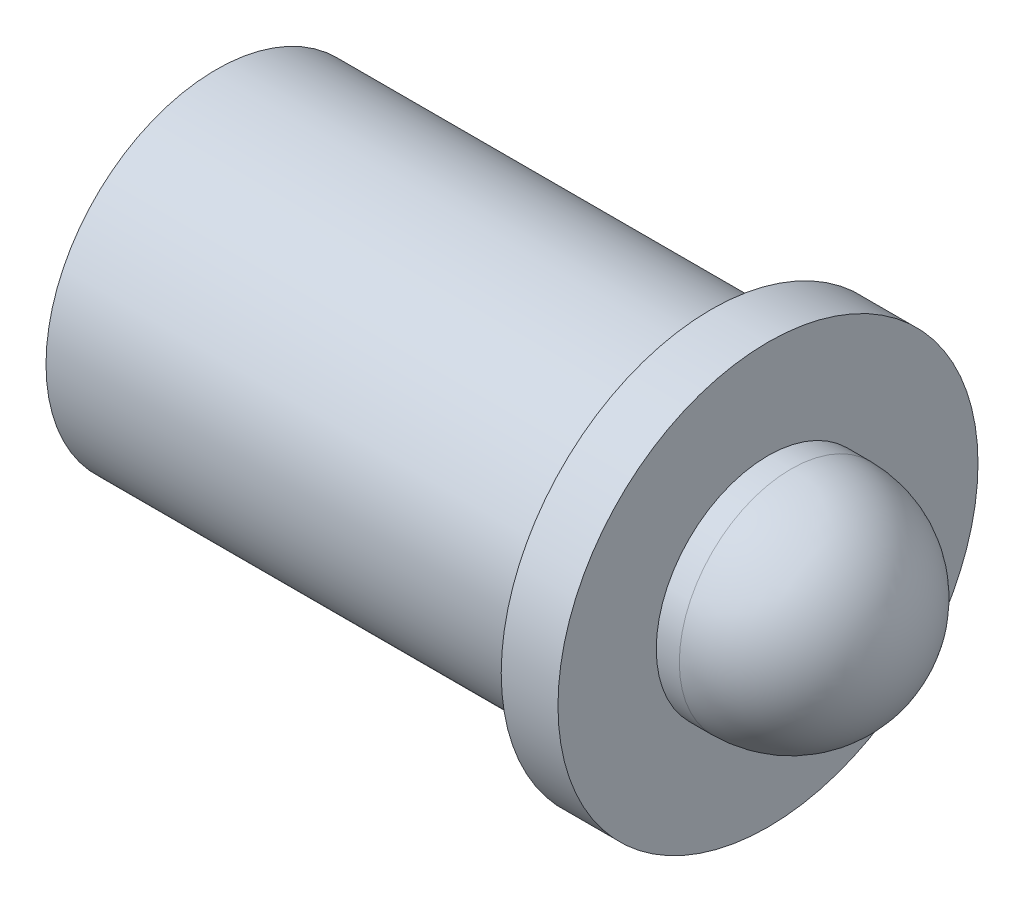
ISO-10303-21;
HEADER;
FILE_DESCRIPTION(('STEP AP214'),'2;1');
FILE_NAME('part.step','',(''),(''),'','','');
FILE_SCHEMA(('AUTOMOTIVE_DESIGN { 1 0 10303 214 1 1 1 1 }'));
ENDSEC;
DATA;
#1=APPLICATION_CONTEXT('core data for automotive mechanical design processes');
#2=APPLICATION_PROTOCOL_DEFINITION('international standard','automotive_design',2000,#1);
#3=PRODUCT_CONTEXT('',#1,'mechanical');
#4=PRODUCT('Part','Part','',(#3));
#5=PRODUCT_RELATED_PRODUCT_CATEGORY('part','',(#4));
#6=PRODUCT_DEFINITION_FORMATION('','',#4);
#7=PRODUCT_DEFINITION_CONTEXT('part definition',#1,'design');
#8=PRODUCT_DEFINITION('design','',#6,#7);
#9=PRODUCT_DEFINITION_SHAPE('','',#8);
#10=(LENGTH_UNIT() NAMED_UNIT(*) SI_UNIT(.MILLI.,.METRE.));
#11=(NAMED_UNIT(*) PLANE_ANGLE_UNIT() SI_UNIT($,.RADIAN.));
#12=(NAMED_UNIT(*) SI_UNIT($,.STERADIAN.) SOLID_ANGLE_UNIT());
#13=UNCERTAINTY_MEASURE_WITH_UNIT(LENGTH_MEASURE(1.E-05),#10,'distance_accuracy_value','');
#14=(GEOMETRIC_REPRESENTATION_CONTEXT(3) GLOBAL_UNCERTAINTY_ASSIGNED_CONTEXT((#13)) GLOBAL_UNIT_ASSIGNED_CONTEXT((#10,
#11,#12)) REPRESENTATION_CONTEXT('',''));
#15=CARTESIAN_POINT('',(0.,0.,0.));
#16=DIRECTION('',(0.,0.,1.));
#17=DIRECTION('',(1.,0.,0.));
#18=AXIS2_PLACEMENT_3D('',#15,#16,#17);
#19=CARTESIAN_POINT('',(0.,0.,0.));
#20=DIRECTION('',(-1.,0.,0.));
#21=DIRECTION('',(0.,0.,1.));
#22=AXIS2_PLACEMENT_3D('',#19,#20,#21);
#23=CYLINDRICAL_SURFACE('',#22,3.302);
#24=CARTESIAN_POINT('',(0.,0.,0.));
#25=DIRECTION('',(-1.,0.,0.));
#26=DIRECTION('',(0.,0.,1.));
#27=AXIS2_PLACEMENT_3D('',#24,#25,#26);
#28=CIRCLE('',#27,3.302);
#29=CARTESIAN_POINT('',(0.,0.,3.302));
#30=VERTEX_POINT('',#29);
#31=EDGE_CURVE('E43',#30,#30,#28,.T.);
#32=ORIENTED_EDGE('',*,*,#31,.T.);
#33=EDGE_LOOP('',(#32));
#34=FACE_BOUND('',#33,.T.);
#35=CARTESIAN_POINT('',(9.2837,0.,0.));
#36=DIRECTION('',(1.,0.,0.));
#37=DIRECTION('',(0.,1.,0.));
#38=AXIS2_PLACEMENT_3D('',#35,#36,#37);
#39=CIRCLE('',#38,3.302);
#40=CARTESIAN_POINT('',(9.2837,3.302,0.));
#41=VERTEX_POINT('',#40);
#42=EDGE_CURVE('E10',#41,#41,#39,.F.);
#43=ORIENTED_EDGE('',*,*,#42,.F.);
#44=EDGE_LOOP('',(#43));
#45=FACE_BOUND('',#44,.T.);
#46=ADVANCED_FACE('F35',(#34,#45),#23,.F.);
#47=CARTESIAN_POINT('',(12.3444,4.699,0.));
#48=DIRECTION('',(-1.,0.,0.));
#49=DIRECTION('',(0.,0.,1.));
#50=AXIS2_PLACEMENT_3D('',#47,#48,#49);
#51=PLANE('',#50);
#52=CARTESIAN_POINT('',(12.3444,0.,0.));
#53=DIRECTION('',(-1.,0.,0.));
#54=DIRECTION('',(0.,0.,1.));
#55=AXIS2_PLACEMENT_3D('',#52,#53,#54);
#56=CIRCLE('',#55,4.699);
#57=CARTESIAN_POINT('',(12.3444,0.,4.699));
#58=VERTEX_POINT('',#57);
#59=EDGE_CURVE('E61',#58,#58,#56,.T.);
#60=ORIENTED_EDGE('',*,*,#59,.F.);
#61=EDGE_LOOP('',(#60));
#62=FACE_BOUND('',#61,.T.);
#63=CARTESIAN_POINT('',(12.3444,0.,0.));
#64=DIRECTION('',(-1.,0.,0.));
#65=DIRECTION('',(0.,0.,1.));
#66=AXIS2_PLACEMENT_3D('',#63,#64,#65);
#67=CIRCLE('',#66,2.5);
#68=CARTESIAN_POINT('',(12.3444,0.,2.5));
#69=VERTEX_POINT('',#68);
#70=EDGE_CURVE('E65',#69,#69,#67,.T.);
#71=ORIENTED_EDGE('',*,*,#70,.T.);
#72=EDGE_LOOP('',(#71));
#73=FACE_BOUND('',#72,.T.);
#74=ADVANCED_FACE('F37',(#62,#73),#51,.F.);
#75=CARTESIAN_POINT('',(0.,3.302,0.));
#76=DIRECTION('',(1.,0.,0.));
#77=DIRECTION('',(0.,0.,-1.));
#78=AXIS2_PLACEMENT_3D('',#75,#76,#77);
#79=PLANE('',#78);
#80=ORIENTED_EDGE('',*,*,#31,.F.);
#81=EDGE_LOOP('',(#80));
#82=FACE_BOUND('',#81,.T.);
#83=CARTESIAN_POINT('',(0.,0.,0.));
#84=DIRECTION('',(-1.,0.,0.));
#85=DIRECTION('',(0.,0.,1.));
#86=AXIS2_PLACEMENT_3D('',#83,#84,#85);
#87=CIRCLE('',#86,3.81);
#88=CARTESIAN_POINT('',(0.,0.,3.81));
#89=VERTEX_POINT('',#88);
#90=EDGE_CURVE('E48',#89,#89,#87,.T.);
#91=ORIENTED_EDGE('',*,*,#90,.T.);
#92=EDGE_LOOP('',(#91));
#93=FACE_BOUND('',#92,.T.);
#94=ADVANCED_FACE('F89',(#82,#93),#79,.F.);
#95=CARTESIAN_POINT('',(0.,0.,0.));
#96=DIRECTION('',(-1.,0.,0.));
#97=DIRECTION('',(0.,0.,1.));
#98=AXIS2_PLACEMENT_3D('',#95,#96,#97);
#99=CYLINDRICAL_SURFACE('',#98,3.81);
#100=ORIENTED_EDGE('',*,*,#90,.F.);
#101=EDGE_LOOP('',(#100));
#102=FACE_BOUND('',#101,.T.);
#103=CARTESIAN_POINT('',(11.0744,0.,0.));
#104=DIRECTION('',(-1.,0.,0.));
#105=DIRECTION('',(0.,0.,1.));
#106=AXIS2_PLACEMENT_3D('',#103,#104,#105);
#107=CIRCLE('',#106,3.81);
#108=CARTESIAN_POINT('',(11.0744,0.,3.81));
#109=VERTEX_POINT('',#108);
#110=EDGE_CURVE('E52',#109,#109,#107,.T.);
#111=ORIENTED_EDGE('',*,*,#110,.T.);
#112=EDGE_LOOP('',(#111));
#113=FACE_BOUND('',#112,.T.);
#114=ADVANCED_FACE('F95',(#102,#113),#99,.T.);
#115=CARTESIAN_POINT('',(11.0744,4.699,0.));
#116=DIRECTION('',(1.,0.,0.));
#117=DIRECTION('',(0.,0.,-1.));
#118=AXIS2_PLACEMENT_3D('',#115,#116,#117);
#119=PLANE('',#118);
#120=ORIENTED_EDGE('',*,*,#110,.F.);
#121=EDGE_LOOP('',(#120));
#122=FACE_BOUND('',#121,.T.);
#123=CARTESIAN_POINT('',(11.0744,0.,0.));
#124=DIRECTION('',(-1.,0.,0.));
#125=DIRECTION('',(0.,0.,1.));
#126=AXIS2_PLACEMENT_3D('',#123,#124,#125);
#127=CIRCLE('',#126,4.699);
#128=CARTESIAN_POINT('',(11.0744,0.,4.699));
#129=VERTEX_POINT('',#128);
#130=EDGE_CURVE('E58',#129,#129,#127,.T.);
#131=ORIENTED_EDGE('',*,*,#130,.T.);
#132=EDGE_LOOP('',(#131));
#133=FACE_BOUND('',#132,.T.);
#134=ADVANCED_FACE('F99',(#122,#133),#119,.F.);
#135=CARTESIAN_POINT('',(0.,0.,0.));
#136=DIRECTION('',(-1.,0.,0.));
#137=DIRECTION('',(0.,0.,1.));
#138=AXIS2_PLACEMENT_3D('',#135,#136,#137);
#139=CYLINDRICAL_SURFACE('',#138,4.699);
#140=ORIENTED_EDGE('',*,*,#130,.F.);
#141=EDGE_LOOP('',(#140));
#142=FACE_BOUND('',#141,.T.);
#143=ORIENTED_EDGE('',*,*,#59,.T.);
#144=EDGE_LOOP('',(#143));
#145=FACE_BOUND('',#144,.T.);
#146=ADVANCED_FACE('F102',(#142,#145),#139,.T.);
#147=CARTESIAN_POINT('',(9.2837,3.302,0.));
#148=DIRECTION('',(1.,0.,0.));
#149=DIRECTION('',(0.,1.,0.));
#150=AXIS2_PLACEMENT_3D('',#147,#148,#149);
#151=PLANE('',#150);
#152=ORIENTED_EDGE('',*,*,#42,.T.);
#153=EDGE_LOOP('',(#152));
#154=FACE_BOUND('',#153,.T.);
#155=ADVANCED_FACE('F81',(#154),#151,.F.);
#156=CARTESIAN_POINT('',(12.8606926200495,0.,0.));
#157=DIRECTION('',(-1.,0.,0.));
#158=DIRECTION('',(0.,-1.,0.));
#159=AXIS2_PLACEMENT_3D('',#156,#157,#158);
#160=CYLINDRICAL_SURFACE('',#159,2.5);
#161=CARTESIAN_POINT('',(12.8606926200495,0.,0.));
#162=DIRECTION('',(-1.,0.,0.));
#163=DIRECTION('',(0.,-1.,0.));
#164=AXIS2_PLACEMENT_3D('',#161,#162,#163);
#165=CIRCLE('',#164,2.5);
#166=CARTESIAN_POINT('',(12.8606926200495,-2.5,0.));
#167=VERTEX_POINT('',#166);
#168=EDGE_CURVE('E68',#167,#167,#165,.T.);
#169=ORIENTED_EDGE('',*,*,#168,.T.);
#170=EDGE_LOOP('',(#169));
#171=FACE_BOUND('',#170,.T.);
#172=ORIENTED_EDGE('',*,*,#70,.F.);
#173=EDGE_LOOP('',(#172));
#174=FACE_BOUND('',#173,.T.);
#175=ADVANCED_FACE('F72',(#171,#174),#160,.T.);
#176=CARTESIAN_POINT('',(12.8606926200495,0.,0.));
#177=DIRECTION('',(-1.,0.,0.));
#178=DIRECTION('',(0.,1.,0.));
#179=AXIS2_PLACEMENT_3D('',#176,#177,#178);
#180=SPHERICAL_SURFACE('',#179,2.5);
#181=ORIENTED_EDGE('',*,*,#168,.F.);
#182=EDGE_LOOP('',(#181));
#183=FACE_BOUND('',#182,.T.);
#184=ADVANCED_FACE('F75',(#183),#180,.T.);
#185=CLOSED_SHELL('',(#46,#74,#94,#114,#134,#146,#155,#175,#184));
#186=MANIFOLD_SOLID_BREP('B2',#185);
#187=ADVANCED_BREP_SHAPE_REPRESENTATION('',(#18,#186),#14);
#188=SHAPE_DEFINITION_REPRESENTATION(#9,#187);
ENDSEC;
END-ISO-10303-21;
